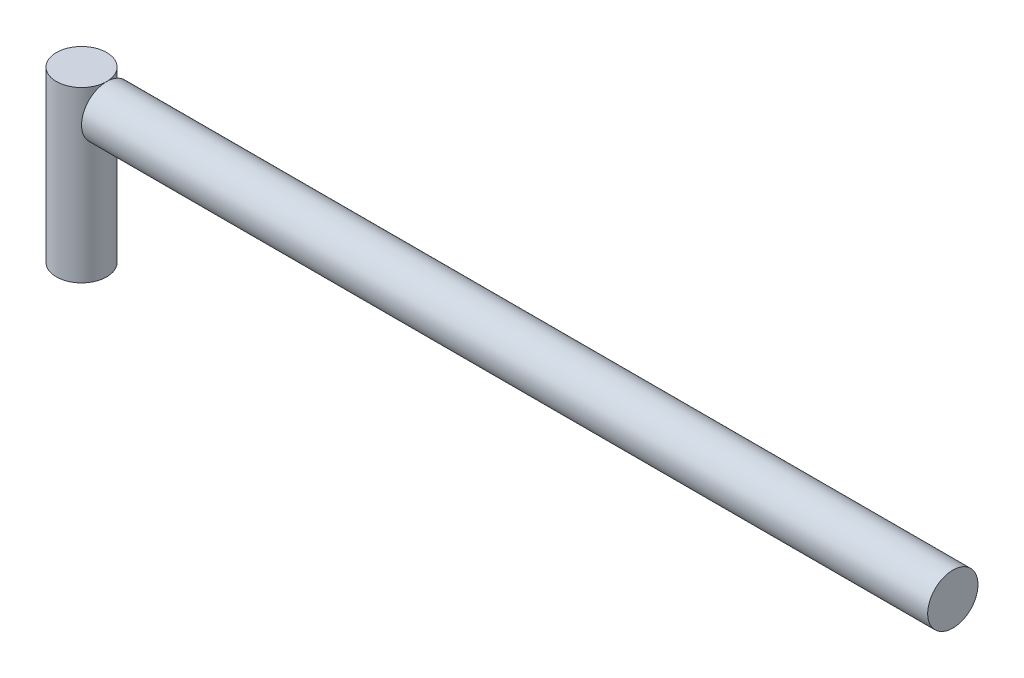
ISO-10303-21;
HEADER;
FILE_DESCRIPTION(('STEP AP214'),'2;1');
FILE_NAME('part.step','',(''),(''),'','','');
FILE_SCHEMA(('AUTOMOTIVE_DESIGN { 1 0 10303 214 1 1 1 1 }'));
ENDSEC;
DATA;
#1=APPLICATION_CONTEXT('core data for automotive mechanical design processes');
#2=APPLICATION_PROTOCOL_DEFINITION('international standard','automotive_design',2000,#1);
#3=PRODUCT_CONTEXT('',#1,'mechanical');
#4=PRODUCT('Part','Part','',(#3));
#5=PRODUCT_RELATED_PRODUCT_CATEGORY('part','',(#4));
#6=PRODUCT_DEFINITION_FORMATION('','',#4);
#7=PRODUCT_DEFINITION_CONTEXT('part definition',#1,'design');
#8=PRODUCT_DEFINITION('design','',#6,#7);
#9=PRODUCT_DEFINITION_SHAPE('','',#8);
#10=(LENGTH_UNIT() NAMED_UNIT(*) SI_UNIT(.MILLI.,.METRE.));
#11=(NAMED_UNIT(*) PLANE_ANGLE_UNIT() SI_UNIT($,.RADIAN.));
#12=(NAMED_UNIT(*) SI_UNIT($,.STERADIAN.) SOLID_ANGLE_UNIT());
#13=UNCERTAINTY_MEASURE_WITH_UNIT(LENGTH_MEASURE(1.E-05),#10,'distance_accuracy_value','');
#14=(GEOMETRIC_REPRESENTATION_CONTEXT(3) GLOBAL_UNCERTAINTY_ASSIGNED_CONTEXT((#13)) GLOBAL_UNIT_ASSIGNED_CONTEXT((#10,
#11,#12)) REPRESENTATION_CONTEXT('',''));
#15=CARTESIAN_POINT('',(0.,0.,0.));
#16=DIRECTION('',(0.,0.,1.));
#17=DIRECTION('',(1.,0.,0.));
#18=AXIS2_PLACEMENT_3D('',#15,#16,#17);
#19=CARTESIAN_POINT('',(5.5,0.,0.));
#20=DIRECTION('',(1.,0.,0.));
#21=DIRECTION('',(0.,0.,-1.));
#22=AXIS2_PLACEMENT_3D('',#19,#20,#21);
#23=PLANE('',#22);
#24=CARTESIAN_POINT('',(5.5,31.5,0.));
#25=DIRECTION('',(1.,0.,0.));
#26=DIRECTION('',(0.,0.,-1.));
#27=AXIS2_PLACEMENT_3D('',#24,#25,#26);
#28=CIRCLE('',#27,5.5);
#29=CARTESIAN_POINT('',(5.5,31.5,-5.5));
#30=VERTEX_POINT('',#29);
#31=EDGE_CURVE('E47',#30,#30,#28,.T.);
#32=ORIENTED_EDGE('',*,*,#31,.F.);
#33=EDGE_LOOP('',(#32));
#34=FACE_BOUND('',#33,.T.);
#35=ADVANCED_FACE('F41',(#34),#23,.F.);
#36=CARTESIAN_POINT('',(190.5,0.,0.));
#37=DIRECTION('',(1.,0.,0.));
#38=DIRECTION('',(0.,0.,-1.));
#39=AXIS2_PLACEMENT_3D('',#36,#37,#38);
#40=PLANE('',#39);
#41=CARTESIAN_POINT('',(190.5,31.5,0.));
#42=DIRECTION('',(1.,0.,0.));
#43=DIRECTION('',(0.,0.,-1.));
#44=AXIS2_PLACEMENT_3D('',#41,#42,#43);
#45=CIRCLE('',#44,5.5);
#46=CARTESIAN_POINT('',(190.5,31.5,-5.5));
#47=VERTEX_POINT('',#46);
#48=EDGE_CURVE('E12',#47,#47,#45,.T.);
#49=ORIENTED_EDGE('',*,*,#48,.T.);
#50=EDGE_LOOP('',(#49));
#51=FACE_BOUND('',#50,.T.);
#52=ADVANCED_FACE('F57',(#51),#40,.T.);
#53=CARTESIAN_POINT('',(5.5,31.5,0.));
#54=DIRECTION('',(1.,0.,0.));
#55=DIRECTION('',(0.,0.,-1.));
#56=AXIS2_PLACEMENT_3D('',#53,#54,#55);
#57=CYLINDRICAL_SURFACE('',#56,5.5);
#58=ORIENTED_EDGE('',*,*,#31,.T.);
#59=EDGE_LOOP('',(#58));
#60=FACE_BOUND('',#59,.T.);
#61=ORIENTED_EDGE('',*,*,#48,.F.);
#62=EDGE_LOOP('',(#61));
#63=FACE_BOUND('',#62,.T.);
#64=ADVANCED_FACE('F53',(#60,#63),#57,.T.);
#65=CLOSED_SHELL('',(#35,#52,#64));
#66=MANIFOLD_SOLID_BREP('B2',#65);
#67=CARTESIAN_POINT('',(0.,37.,0.));
#68=DIRECTION('',(0.,-1.,0.));
#69=DIRECTION('',(0.,0.,-1.));
#70=AXIS2_PLACEMENT_3D('',#67,#68,#69);
#71=CYLINDRICAL_SURFACE('',#70,5.5);
#72=CARTESIAN_POINT('',(0.,37.,0.));
#73=DIRECTION('',(0.,1.,0.));
#74=DIRECTION('',(0.,0.,1.));
#75=AXIS2_PLACEMENT_3D('',#72,#73,#74);
#76=CIRCLE('',#75,5.5);
#77=CARTESIAN_POINT('',(0.,37.,5.5));
#78=VERTEX_POINT('',#77);
#79=EDGE_CURVE('E40',#78,#78,#76,.T.);
#80=ORIENTED_EDGE('',*,*,#79,.F.);
#81=EDGE_LOOP('',(#80));
#82=FACE_BOUND('',#81,.T.);
#83=CARTESIAN_POINT('',(0.,0.,0.));
#84=DIRECTION('',(0.,1.,0.));
#85=DIRECTION('',(0.,0.,1.));
#86=AXIS2_PLACEMENT_3D('',#83,#84,#85);
#87=CIRCLE('',#86,5.5);
#88=CARTESIAN_POINT('',(0.,0.,5.5));
#89=VERTEX_POINT('',#88);
#90=EDGE_CURVE('E84',#89,#89,#87,.T.);
#91=ORIENTED_EDGE('',*,*,#90,.T.);
#92=EDGE_LOOP('',(#91));
#93=FACE_BOUND('',#92,.T.);
#94=ADVANCED_FACE('F81',(#82,#93),#71,.T.);
#95=CARTESIAN_POINT('',(0.,37.,0.));
#96=DIRECTION('',(0.,1.,0.));
#97=DIRECTION('',(0.,0.,1.));
#98=AXIS2_PLACEMENT_3D('',#95,#96,#97);
#99=PLANE('',#98);
#100=ORIENTED_EDGE('',*,*,#79,.T.);
#101=EDGE_LOOP('',(#100));
#102=FACE_BOUND('',#101,.T.);
#103=ADVANCED_FACE('F110',(#102),#99,.T.);
#104=CARTESIAN_POINT('',(0.,0.,0.));
#105=DIRECTION('',(0.,1.,0.));
#106=DIRECTION('',(0.,0.,1.));
#107=AXIS2_PLACEMENT_3D('',#104,#105,#106);
#108=PLANE('',#107);
#109=CARTESIAN_POINT('',(0.,0.,0.));
#110=DIRECTION('',(0.,-1.,0.));
#111=DIRECTION('',(0.,0.,-1.));
#112=AXIS2_PLACEMENT_3D('',#109,#110,#111);
#113=CIRCLE('',#112,1.55);
#114=CARTESIAN_POINT('',(0.,0.,-1.55));
#115=VERTEX_POINT('',#114);
#116=EDGE_CURVE('E93',#115,#115,#113,.T.);
#117=ORIENTED_EDGE('',*,*,#116,.F.);
#118=EDGE_LOOP('',(#117));
#119=FACE_BOUND('',#118,.T.);
#120=ORIENTED_EDGE('',*,*,#90,.F.);
#121=EDGE_LOOP('',(#120));
#122=FACE_BOUND('',#121,.T.);
#123=ADVANCED_FACE('F104',(#119,#122),#108,.F.);
#124=CARTESIAN_POINT('',(0.,11.72,0.));
#125=DIRECTION('',(0.,-1.,0.));
#126=DIRECTION('',(0.,0.,-1.));
#127=AXIS2_PLACEMENT_3D('',#124,#125,#126);
#128=CYLINDRICAL_SURFACE('',#127,1.55);
#129=CARTESIAN_POINT('',(0.,11.72,0.));
#130=DIRECTION('',(0.,-1.,0.));
#131=DIRECTION('',(0.,0.,-1.));
#132=AXIS2_PLACEMENT_3D('',#129,#130,#131);
#133=CIRCLE('',#132,1.55);
#134=CARTESIAN_POINT('',(0.,11.72,-1.55));
#135=VERTEX_POINT('',#134);
#136=EDGE_CURVE('E91',#135,#135,#133,.T.);
#137=CARTESIAN_POINT('',(0.,11.72,-1.55));
#138=CARTESIAN_POINT('',(0.,11.5979166666667,-1.55));
#139=CARTESIAN_POINT('',(0.,11.4758333333333,-1.55));
#140=CARTESIAN_POINT('',(0.,11.2316666666667,-1.55));
#141=CARTESIAN_POINT('',(0.,11.1095833333333,-1.55));
#142=CARTESIAN_POINT('',(0.,10.8654166666667,-1.55));
#143=CARTESIAN_POINT('',(0.,10.7433333333333,-1.55));
#144=CARTESIAN_POINT('',(0.,10.4991666666667,-1.55));
#145=CARTESIAN_POINT('',(0.,10.3770833333333,-1.55));
#146=CARTESIAN_POINT('',(0.,10.1329166666667,-1.55));
#147=CARTESIAN_POINT('',(0.,10.0108333333333,-1.55));
#148=CARTESIAN_POINT('',(0.,9.76666666666667,-1.55));
#149=CARTESIAN_POINT('',(0.,9.64458333333334,-1.55));
#150=CARTESIAN_POINT('',(0.,9.40041666666667,-1.55));
#151=CARTESIAN_POINT('',(0.,9.27833333333333,-1.55));
#152=CARTESIAN_POINT('',(0.,9.03416666666667,-1.55));
#153=CARTESIAN_POINT('',(0.,8.91208333333334,-1.55));
#154=CARTESIAN_POINT('',(0.,8.66791666666667,-1.55));
#155=CARTESIAN_POINT('',(0.,8.54583333333333,-1.55));
#156=CARTESIAN_POINT('',(0.,8.30166666666667,-1.55));
#157=CARTESIAN_POINT('',(0.,8.17958333333334,-1.55));
#158=CARTESIAN_POINT('',(0.,7.93541666666667,-1.55));
#159=CARTESIAN_POINT('',(0.,7.81333333333334,-1.55));
#160=CARTESIAN_POINT('',(0.,7.56916666666667,-1.55));
#161=CARTESIAN_POINT('',(0.,7.44708333333334,-1.55));
#162=CARTESIAN_POINT('',(0.,7.20291666666667,-1.55));
#163=CARTESIAN_POINT('',(0.,7.08083333333333,-1.55));
#164=CARTESIAN_POINT('',(0.,6.83666666666667,-1.55));
#165=CARTESIAN_POINT('',(0.,6.71458333333334,-1.55));
#166=CARTESIAN_POINT('',(0.,6.47041666666667,-1.55));
#167=CARTESIAN_POINT('',(0.,6.34833333333334,-1.55));
#168=CARTESIAN_POINT('',(0.,6.10416666666667,-1.55));
#169=CARTESIAN_POINT('',(0.,5.98208333333333,-1.55));
#170=CARTESIAN_POINT('',(0.,5.73791666666667,-1.55));
#171=CARTESIAN_POINT('',(0.,5.61583333333333,-1.55));
#172=CARTESIAN_POINT('',(0.,5.37166666666667,-1.55));
#173=CARTESIAN_POINT('',(0.,5.24958333333333,-1.55));
#174=CARTESIAN_POINT('',(0.,5.00541666666667,-1.55));
#175=CARTESIAN_POINT('',(0.,4.88333333333333,-1.55));
#176=CARTESIAN_POINT('',(0.,4.63916666666667,-1.55));
#177=CARTESIAN_POINT('',(0.,4.51708333333333,-1.55));
#178=CARTESIAN_POINT('',(0.,4.27291666666667,-1.55));
#179=CARTESIAN_POINT('',(0.,4.15083333333333,-1.55));
#180=CARTESIAN_POINT('',(0.,3.90666666666667,-1.55));
#181=CARTESIAN_POINT('',(0.,3.78458333333334,-1.55));
#182=CARTESIAN_POINT('',(0.,3.54041666666667,-1.55));
#183=CARTESIAN_POINT('',(0.,3.41833333333334,-1.55));
#184=CARTESIAN_POINT('',(0.,3.17416666666667,-1.55));
#185=CARTESIAN_POINT('',(0.,3.05208333333334,-1.55));
#186=CARTESIAN_POINT('',(0.,2.80791666666667,-1.55));
#187=CARTESIAN_POINT('',(0.,2.68583333333334,-1.55));
#188=CARTESIAN_POINT('',(0.,2.44166666666667,-1.55));
#189=CARTESIAN_POINT('',(0.,2.31958333333333,-1.55));
#190=CARTESIAN_POINT('',(0.,2.07541666666667,-1.55));
#191=CARTESIAN_POINT('',(0.,1.95333333333334,-1.55));
#192=CARTESIAN_POINT('',(0.,1.70916666666667,-1.55));
#193=CARTESIAN_POINT('',(0.,1.58708333333334,-1.55));
#194=CARTESIAN_POINT('',(0.,1.34291666666667,-1.55));
#195=CARTESIAN_POINT('',(0.,1.22083333333334,-1.55));
#196=CARTESIAN_POINT('',(0.,0.976666666666669,-1.55));
#197=CARTESIAN_POINT('',(0.,0.854583333333336,-1.55));
#198=CARTESIAN_POINT('',(0.,0.610416666666669,-1.55));
#199=CARTESIAN_POINT('',(0.,0.488333333333335,-1.55));
#200=CARTESIAN_POINT('',(0.,0.244166666666669,-1.55));
#201=CARTESIAN_POINT('',(0.,0.122083333333335,-1.55));
#202=CARTESIAN_POINT('',(0.,0.,-1.55));
#203=B_SPLINE_CURVE_WITH_KNOTS('',3,(#137,#138,#139,#140,#141,#142,#143,#144,#145,#146,#147,
#148,#149,#150,#151,#152,#153,#154,#155,#156,#157,#158,#159,#160,#161,#162,#163,#164,#165,#166,
#167,#168,#169,#170,#171,#172,#173,#174,#175,#176,#177,#178,#179,#180,#181,#182,#183,#184,#185,
#186,#187,#188,#189,#190,#191,#192,#193,#194,#195,#196,#197,#198,#199,#200,#201,#202),
.UNSPECIFIED.,.F.,.F.,(4,2,2,2,2,2,2,2,2,2,2,2,2,2,2,2,2,2,2,2,2,2,2,2,2,2,2,2,2,2,2,2,4),(0.,
0.36625,0.7325,1.09875,1.465,1.83125,2.1975,2.56375,2.93,3.29625,3.6625,4.02875,4.395,4.76125,
5.1275,5.49375,5.86,6.22625,6.5925,6.95875,7.325,7.69125,8.0575,8.42375,8.79,9.15625,9.5225,
9.88875,10.255,10.62125,10.9875,11.35375,11.72),.UNSPECIFIED.);
#204=EDGE_CURVE('BSEAM101',#135,#115,#203,.T.);
#205=ORIENTED_EDGE('',*,*,#136,.F.);
#206=ORIENTED_EDGE('',*,*,#116,.T.);
#207=ORIENTED_EDGE('',*,*,#204,.T.);
#208=ORIENTED_EDGE('',*,*,#204,.F.);
#209=EDGE_LOOP('',(#205,#207,#206,#208));
#210=FACE_BOUND('',#209,.T.);
#211=ADVANCED_FACE('F101',(#210),#128,.F.);
#212=CARTESIAN_POINT('',(0.,11.72,0.));
#213=DIRECTION('',(0.,-1.,0.));
#214=DIRECTION('',(0.,0.,-1.));
#215=AXIS2_PLACEMENT_3D('',#212,#213,#214);
#216=PLANE('',#215);
#217=ORIENTED_EDGE('',*,*,#136,.T.);
#218=EDGE_LOOP('',(#217));
#219=FACE_BOUND('',#218,.T.);
#220=ADVANCED_FACE('F99',(#219),#216,.T.);
#221=CLOSED_SHELL('',(#94,#103,#123,#211,#220));
#222=MANIFOLD_SOLID_BREP('B7',#221);
#223=ADVANCED_BREP_SHAPE_REPRESENTATION('',(#18,#66,#222),#14);
#224=SHAPE_DEFINITION_REPRESENTATION(#9,#223);
ENDSEC;
END-ISO-10303-21;
